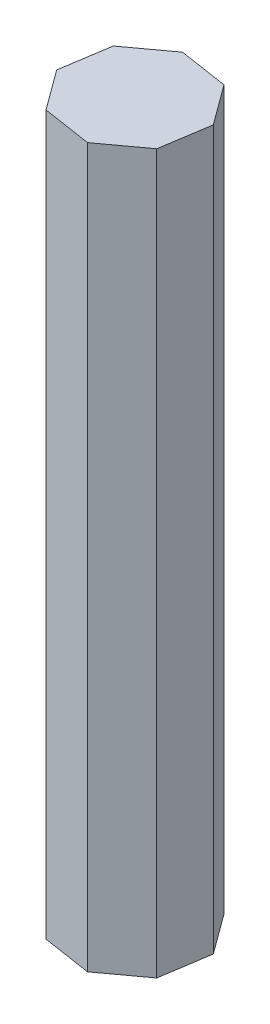
ISO-10303-21;
HEADER;
FILE_DESCRIPTION(('STEP AP214'),'2;1');
FILE_NAME('part.step','',(''),(''),'','','');
FILE_SCHEMA(('AUTOMOTIVE_DESIGN { 1 0 10303 214 1 1 1 1 }'));
ENDSEC;
DATA;
#1=APPLICATION_CONTEXT('core data for automotive mechanical design processes');
#2=APPLICATION_PROTOCOL_DEFINITION('international standard','automotive_design',2000,#1);
#3=PRODUCT_CONTEXT('',#1,'mechanical');
#4=PRODUCT('Part','Part','',(#3));
#5=PRODUCT_RELATED_PRODUCT_CATEGORY('part','',(#4));
#6=PRODUCT_DEFINITION_FORMATION('','',#4);
#7=PRODUCT_DEFINITION_CONTEXT('part definition',#1,'design');
#8=PRODUCT_DEFINITION('design','',#6,#7);
#9=PRODUCT_DEFINITION_SHAPE('','',#8);
#10=(LENGTH_UNIT() NAMED_UNIT(*) SI_UNIT(.MILLI.,.METRE.));
#11=(NAMED_UNIT(*) PLANE_ANGLE_UNIT() SI_UNIT($,.RADIAN.));
#12=(NAMED_UNIT(*) SI_UNIT($,.STERADIAN.) SOLID_ANGLE_UNIT());
#13=UNCERTAINTY_MEASURE_WITH_UNIT(LENGTH_MEASURE(1.E-05),#10,'distance_accuracy_value','');
#14=(GEOMETRIC_REPRESENTATION_CONTEXT(3) GLOBAL_UNCERTAINTY_ASSIGNED_CONTEXT((#13)) GLOBAL_UNIT_ASSIGNED_CONTEXT((#10,
#11,#12)) REPRESENTATION_CONTEXT('',''));
#15=CARTESIAN_POINT('',(0.,0.,0.));
#16=DIRECTION('',(0.,0.,1.));
#17=DIRECTION('',(1.,0.,0.));
#18=AXIS2_PLACEMENT_3D('',#15,#16,#17);
#19=CARTESIAN_POINT('',(3.26229639702648,-152.4,13.3536665851606));
#20=DIRECTION('',(0.591006161325808,0.,0.806667042387956));
#21=DIRECTION('',(0.806667042387956,0.,-0.591006161325808));
#22=AXIS2_PLACEMENT_3D('',#19,#20,#21);
#23=PLANE('',#22);
#24=DIRECTION('',(0.806667042387956,0.,-0.591006161325808));
#25=VECTOR('',#24,1.);
#26=CARTESIAN_POINT('',(3.26229639702648,0.,13.3536665851606));
#27=LINE('',#26,#25);
#28=CARTESIAN_POINT('',(3.26229639702648,0.,13.3536665851606));
#29=VERTEX_POINT('',#28);
#30=CARTESIAN_POINT('',(11.7492601006491,0.,7.13567629149351));
#31=VERTEX_POINT('',#30);
#32=EDGE_CURVE('E134',#29,#31,#27,.T.);
#33=ORIENTED_EDGE('',*,*,#32,.F.);
#34=DIRECTION('',(0.,1.,0.));
#35=VECTOR('',#34,1.);
#36=CARTESIAN_POINT('',(3.26229639702648,-152.4,13.3536665851606));
#37=LINE('',#36,#35);
#38=CARTESIAN_POINT('',(3.26229639702648,-152.4,13.3536665851606));
#39=VERTEX_POINT('',#38);
#40=EDGE_CURVE('E11',#39,#29,#37,.T.);
#41=ORIENTED_EDGE('',*,*,#40,.F.);
#42=DIRECTION('',(0.806667042387956,0.,-0.591006161325808));
#43=VECTOR('',#42,1.);
#44=CARTESIAN_POINT('',(3.26229639702648,-152.4,13.3536665851606));
#45=LINE('',#44,#43);
#46=CARTESIAN_POINT('',(11.7492601006491,-152.4,7.13567629149351));
#47=VERTEX_POINT('',#46);
#48=EDGE_CURVE('E154',#39,#47,#45,.T.);
#49=ORIENTED_EDGE('',*,*,#48,.T.);
#50=DIRECTION('',(0.,1.,0.));
#51=VECTOR('',#50,1.);
#52=CARTESIAN_POINT('',(11.7492601006491,-152.4,7.13567629149351));
#53=LINE('',#52,#51);
#54=EDGE_CURVE('E40',#47,#31,#53,.T.);
#55=ORIENTED_EDGE('',*,*,#54,.T.);
#56=EDGE_LOOP('',(#33,#41,#49,#55));
#57=FACE_BOUND('',#56,.T.);
#58=ADVANCED_FACE('F37',(#57),#23,.T.);
#59=CARTESIAN_POINT('',(-7.1356762914934,-152.4,11.7492601006491));
#60=DIRECTION('',(-0.152495271435705,0.,0.98830420022873));
#61=DIRECTION('',(0.988304200228731,0.,0.152495271435705));
#62=AXIS2_PLACEMENT_3D('',#59,#60,#61);
#63=PLANE('',#62);
#64=DIRECTION('',(0.98830420022873,0.,0.152495271435705));
#65=VECTOR('',#64,1.);
#66=CARTESIAN_POINT('',(-7.1356762914934,0.,11.7492601006491));
#67=LINE('',#66,#65);
#68=CARTESIAN_POINT('',(-7.1356762914934,0.,11.7492601006491));
#69=VERTEX_POINT('',#68);
#70=EDGE_CURVE('E152',#69,#29,#67,.T.);
#71=ORIENTED_EDGE('',*,*,#70,.F.);
#72=DIRECTION('',(0.,1.,0.));
#73=VECTOR('',#72,1.);
#74=CARTESIAN_POINT('',(-7.1356762914934,-152.4,11.7492601006491));
#75=LINE('',#74,#73);
#76=CARTESIAN_POINT('',(-7.1356762914934,-152.4,11.7492601006491));
#77=VERTEX_POINT('',#76);
#78=EDGE_CURVE('E46',#77,#69,#75,.T.);
#79=ORIENTED_EDGE('',*,*,#78,.F.);
#80=DIRECTION('',(0.98830420022873,0.,0.152495271435705));
#81=VECTOR('',#80,1.);
#82=CARTESIAN_POINT('',(-7.1356762914934,-152.4,11.7492601006491));
#83=LINE('',#82,#81);
#84=EDGE_CURVE('E124',#77,#39,#83,.T.);
#85=ORIENTED_EDGE('',*,*,#84,.T.);
#86=ORIENTED_EDGE('',*,*,#40,.T.);
#87=EDGE_LOOP('',(#71,#79,#85,#86));
#88=FACE_BOUND('',#87,.T.);
#89=ADVANCED_FACE('F166',(#88),#63,.T.);
#90=CARTESIAN_POINT('',(-13.3536665851606,-152.4,3.26229639702637));
#91=DIRECTION('',(-0.806667042387956,0.,0.591006161325809));
#92=DIRECTION('',(0.591006161325809,0.,0.806667042387956));
#93=AXIS2_PLACEMENT_3D('',#90,#91,#92);
#94=PLANE('',#93);
#95=DIRECTION('',(0.591006161325809,0.,0.806667042387956));
#96=VECTOR('',#95,1.);
#97=CARTESIAN_POINT('',(-13.3536665851606,0.,3.26229639702637));
#98=LINE('',#97,#96);
#99=CARTESIAN_POINT('',(-13.3536665851606,0.,3.26229639702637));
#100=VERTEX_POINT('',#99);
#101=EDGE_CURVE('E111',#100,#69,#98,.T.);
#102=ORIENTED_EDGE('',*,*,#101,.F.);
#103=DIRECTION('',(0.,1.,0.));
#104=VECTOR('',#103,1.);
#105=CARTESIAN_POINT('',(-13.3536665851606,-152.4,3.26229639702637));
#106=LINE('',#105,#104);
#107=CARTESIAN_POINT('',(-13.3536665851606,-152.4,3.26229639702637));
#108=VERTEX_POINT('',#107);
#109=EDGE_CURVE('E106',#108,#100,#106,.T.);
#110=ORIENTED_EDGE('',*,*,#109,.F.);
#111=DIRECTION('',(0.591006161325809,0.,0.806667042387956));
#112=VECTOR('',#111,1.);
#113=CARTESIAN_POINT('',(-13.3536665851606,-152.4,3.26229639702637));
#114=LINE('',#113,#112);
#115=EDGE_CURVE('E109',#108,#77,#114,.T.);
#116=ORIENTED_EDGE('',*,*,#115,.T.);
#117=ORIENTED_EDGE('',*,*,#78,.T.);
#118=EDGE_LOOP('',(#102,#110,#116,#117));
#119=FACE_BOUND('',#118,.T.);
#120=ADVANCED_FACE('F108',(#119),#94,.T.);
#121=CARTESIAN_POINT('',(-11.7492601006491,-152.4,-7.1356762914934));
#122=DIRECTION('',(-0.98830420022873,0.,-0.152495271435709));
#123=DIRECTION('',(-0.152495271435709,0.,0.98830420022873));
#124=AXIS2_PLACEMENT_3D('',#121,#122,#123);
#125=PLANE('',#124);
#126=DIRECTION('',(-0.152495271435709,0.,0.98830420022873));
#127=VECTOR('',#126,1.);
#128=CARTESIAN_POINT('',(-11.7492601006491,0.,-7.1356762914934));
#129=LINE('',#128,#127);
#130=CARTESIAN_POINT('',(-11.7492601006491,0.,-7.1356762914934));
#131=VERTEX_POINT('',#130);
#132=EDGE_CURVE('E149',#131,#100,#129,.T.);
#133=ORIENTED_EDGE('',*,*,#132,.F.);
#134=DIRECTION('',(0.,1.,0.));
#135=VECTOR('',#134,1.);
#136=CARTESIAN_POINT('',(-11.7492601006491,-152.4,-7.1356762914934));
#137=LINE('',#136,#135);
#138=CARTESIAN_POINT('',(-11.7492601006491,-152.4,-7.1356762914934));
#139=VERTEX_POINT('',#138);
#140=EDGE_CURVE('E116',#139,#131,#137,.T.);
#141=ORIENTED_EDGE('',*,*,#140,.F.);
#142=DIRECTION('',(-0.152495271435709,0.,0.98830420022873));
#143=VECTOR('',#142,1.);
#144=CARTESIAN_POINT('',(-11.7492601006491,-152.4,-7.1356762914934));
#145=LINE('',#144,#143);
#146=EDGE_CURVE('E122',#139,#108,#145,.T.);
#147=ORIENTED_EDGE('',*,*,#146,.T.);
#148=ORIENTED_EDGE('',*,*,#109,.T.);
#149=EDGE_LOOP('',(#133,#141,#147,#148));
#150=FACE_BOUND('',#149,.T.);
#151=ADVANCED_FACE('F126',(#150),#125,.T.);
#152=CARTESIAN_POINT('',(-3.26229639702649,-152.4,-13.3536665851606));
#153=DIRECTION('',(-0.591006161325813,0.,-0.806667042387953));
#154=DIRECTION('',(-0.806667042387953,0.,0.591006161325813));
#155=AXIS2_PLACEMENT_3D('',#152,#153,#154);
#156=PLANE('',#155);
#157=DIRECTION('',(-0.806667042387953,0.,0.591006161325813));
#158=VECTOR('',#157,1.);
#159=CARTESIAN_POINT('',(-3.26229639702649,0.,-13.3536665851606));
#160=LINE('',#159,#158);
#161=CARTESIAN_POINT('',(-3.26229639702649,0.,-13.3536665851606));
#162=VERTEX_POINT('',#161);
#163=EDGE_CURVE('E146',#162,#131,#160,.T.);
#164=ORIENTED_EDGE('',*,*,#163,.F.);
#165=DIRECTION('',(0.,1.,0.));
#166=VECTOR('',#165,1.);
#167=CARTESIAN_POINT('',(-3.26229639702649,-152.4,-13.3536665851606));
#168=LINE('',#167,#166);
#169=CARTESIAN_POINT('',(-3.26229639702649,-152.4,-13.3536665851606));
#170=VERTEX_POINT('',#169);
#171=EDGE_CURVE('E158',#170,#162,#168,.T.);
#172=ORIENTED_EDGE('',*,*,#171,.F.);
#173=DIRECTION('',(-0.806667042387953,0.,0.591006161325813));
#174=VECTOR('',#173,1.);
#175=CARTESIAN_POINT('',(-3.26229639702649,-152.4,-13.3536665851606));
#176=LINE('',#175,#174);
#177=EDGE_CURVE('E127',#170,#139,#176,.T.);
#178=ORIENTED_EDGE('',*,*,#177,.T.);
#179=ORIENTED_EDGE('',*,*,#140,.T.);
#180=EDGE_LOOP('',(#164,#172,#178,#179));
#181=FACE_BOUND('',#180,.T.);
#182=ADVANCED_FACE('F179',(#181),#156,.T.);
#183=CARTESIAN_POINT('',(7.13567629149339,-152.4,-11.7492601006491));
#184=DIRECTION('',(0.152495271435705,0.,-0.98830420022873));
#185=DIRECTION('',(-0.988304200228731,0.,-0.152495271435705));
#186=AXIS2_PLACEMENT_3D('',#183,#184,#185);
#187=PLANE('',#186);
#188=DIRECTION('',(-0.98830420022873,0.,-0.152495271435705));
#189=VECTOR('',#188,1.);
#190=CARTESIAN_POINT('',(7.13567629149339,0.,-11.7492601006491));
#191=LINE('',#190,#189);
#192=CARTESIAN_POINT('',(7.13567629149339,0.,-11.7492601006491));
#193=VERTEX_POINT('',#192);
#194=EDGE_CURVE('E143',#193,#162,#191,.T.);
#195=ORIENTED_EDGE('',*,*,#194,.F.);
#196=DIRECTION('',(0.,1.,0.));
#197=VECTOR('',#196,1.);
#198=CARTESIAN_POINT('',(7.13567629149339,-152.4,-11.7492601006491));
#199=LINE('',#198,#197);
#200=CARTESIAN_POINT('',(7.13567629149339,-152.4,-11.7492601006491));
#201=VERTEX_POINT('',#200);
#202=EDGE_CURVE('E160',#201,#193,#199,.T.);
#203=ORIENTED_EDGE('',*,*,#202,.F.);
#204=DIRECTION('',(-0.98830420022873,0.,-0.152495271435705));
#205=VECTOR('',#204,1.);
#206=CARTESIAN_POINT('',(7.13567629149339,-152.4,-11.7492601006491));
#207=LINE('',#206,#205);
#208=EDGE_CURVE('E129',#201,#170,#207,.T.);
#209=ORIENTED_EDGE('',*,*,#208,.T.);
#210=ORIENTED_EDGE('',*,*,#171,.T.);
#211=EDGE_LOOP('',(#195,#203,#209,#210));
#212=FACE_BOUND('',#211,.T.);
#213=ADVANCED_FACE('F182',(#212),#187,.T.);
#214=CARTESIAN_POINT('',(13.3536665851606,-152.4,-3.26229639702649));
#215=DIRECTION('',(0.806667042387953,0.,-0.591006161325812));
#216=DIRECTION('',(-0.591006161325812,0.,-0.806667042387953));
#217=AXIS2_PLACEMENT_3D('',#214,#215,#216);
#218=PLANE('',#217);
#219=DIRECTION('',(-0.591006161325812,0.,-0.806667042387953));
#220=VECTOR('',#219,1.);
#221=CARTESIAN_POINT('',(13.3536665851606,0.,-3.26229639702649));
#222=LINE('',#221,#220);
#223=CARTESIAN_POINT('',(13.3536665851606,0.,-3.26229639702649));
#224=VERTEX_POINT('',#223);
#225=EDGE_CURVE('E140',#224,#193,#222,.T.);
#226=ORIENTED_EDGE('',*,*,#225,.F.);
#227=DIRECTION('',(0.,1.,0.));
#228=VECTOR('',#227,1.);
#229=CARTESIAN_POINT('',(13.3536665851606,-152.4,-3.26229639702649));
#230=LINE('',#229,#228);
#231=CARTESIAN_POINT('',(13.3536665851606,-152.4,-3.26229639702649));
#232=VERTEX_POINT('',#231);
#233=EDGE_CURVE('E161',#232,#224,#230,.T.);
#234=ORIENTED_EDGE('',*,*,#233,.F.);
#235=DIRECTION('',(-0.591006161325812,0.,-0.806667042387953));
#236=VECTOR('',#235,1.);
#237=CARTESIAN_POINT('',(13.3536665851606,-152.4,-3.26229639702649));
#238=LINE('',#237,#236);
#239=EDGE_CURVE('E257',#232,#201,#238,.T.);
#240=ORIENTED_EDGE('',*,*,#239,.T.);
#241=ORIENTED_EDGE('',*,*,#202,.T.);
#242=EDGE_LOOP('',(#226,#234,#240,#241));
#243=FACE_BOUND('',#242,.T.);
#244=ADVANCED_FACE('F186',(#243),#218,.T.);
#245=CARTESIAN_POINT('',(11.7492601006491,-152.4,7.13567629149351));
#246=DIRECTION('',(0.98830420022873,0.,0.15249527143571));
#247=DIRECTION('',(0.15249527143571,0.,-0.98830420022873));
#248=AXIS2_PLACEMENT_3D('',#245,#246,#247);
#249=PLANE('',#248);
#250=DIRECTION('',(0.15249527143571,0.,-0.98830420022873));
#251=VECTOR('',#250,1.);
#252=CARTESIAN_POINT('',(11.7492601006491,0.,7.13567629149351));
#253=LINE('',#252,#251);
#254=EDGE_CURVE('E137',#31,#224,#253,.T.);
#255=ORIENTED_EDGE('',*,*,#254,.F.);
#256=ORIENTED_EDGE('',*,*,#54,.F.);
#257=DIRECTION('',(0.15249527143571,0.,-0.98830420022873));
#258=VECTOR('',#257,1.);
#259=CARTESIAN_POINT('',(11.7492601006491,-152.4,7.13567629149351));
#260=LINE('',#259,#258);
#261=EDGE_CURVE('E258',#47,#232,#260,.T.);
#262=ORIENTED_EDGE('',*,*,#261,.T.);
#263=ORIENTED_EDGE('',*,*,#233,.T.);
#264=EDGE_LOOP('',(#255,#256,#262,#263));
#265=FACE_BOUND('',#264,.T.);
#266=ADVANCED_FACE('F163',(#265),#249,.T.);
#267=CARTESIAN_POINT('',(0.,-152.4,0.));
#268=DIRECTION('',(0.,1.,0.));
#269=DIRECTION('',(0.,0.,1.));
#270=AXIS2_PLACEMENT_3D('',#267,#268,#269);
#271=PLANE('',#270);
#272=ORIENTED_EDGE('',*,*,#48,.F.);
#273=ORIENTED_EDGE('',*,*,#84,.F.);
#274=ORIENTED_EDGE('',*,*,#115,.F.);
#275=ORIENTED_EDGE('',*,*,#146,.F.);
#276=ORIENTED_EDGE('',*,*,#177,.F.);
#277=ORIENTED_EDGE('',*,*,#208,.F.);
#278=ORIENTED_EDGE('',*,*,#239,.F.);
#279=ORIENTED_EDGE('',*,*,#261,.F.);
#280=EDGE_LOOP('',(#272,#273,#274,#275,#276,#277,#278,#279));
#281=FACE_BOUND('',#280,.T.);
#282=ADVANCED_FACE('F120',(#281),#271,.F.);
#283=CARTESIAN_POINT('',(0.,0.,0.));
#284=DIRECTION('',(0.,1.,0.));
#285=DIRECTION('',(0.,0.,1.));
#286=AXIS2_PLACEMENT_3D('',#283,#284,#285);
#287=PLANE('',#286);
#288=ORIENTED_EDGE('',*,*,#32,.T.);
#289=ORIENTED_EDGE('',*,*,#254,.T.);
#290=ORIENTED_EDGE('',*,*,#225,.T.);
#291=ORIENTED_EDGE('',*,*,#194,.T.);
#292=ORIENTED_EDGE('',*,*,#163,.T.);
#293=ORIENTED_EDGE('',*,*,#132,.T.);
#294=ORIENTED_EDGE('',*,*,#101,.T.);
#295=ORIENTED_EDGE('',*,*,#70,.T.);
#296=EDGE_LOOP('',(#288,#289,#290,#291,#292,#293,#294,#295));
#297=FACE_BOUND('',#296,.T.);
#298=ADVANCED_FACE('F165',(#297),#287,.T.);
#299=CLOSED_SHELL('',(#58,#89,#120,#151,#182,#213,#244,#266,#282,#298));
#300=MANIFOLD_SOLID_BREP('B2',#299);
#301=ADVANCED_BREP_SHAPE_REPRESENTATION('',(#18,#300),#14);
#302=SHAPE_DEFINITION_REPRESENTATION(#9,#301);
ENDSEC;
END-ISO-10303-21;
